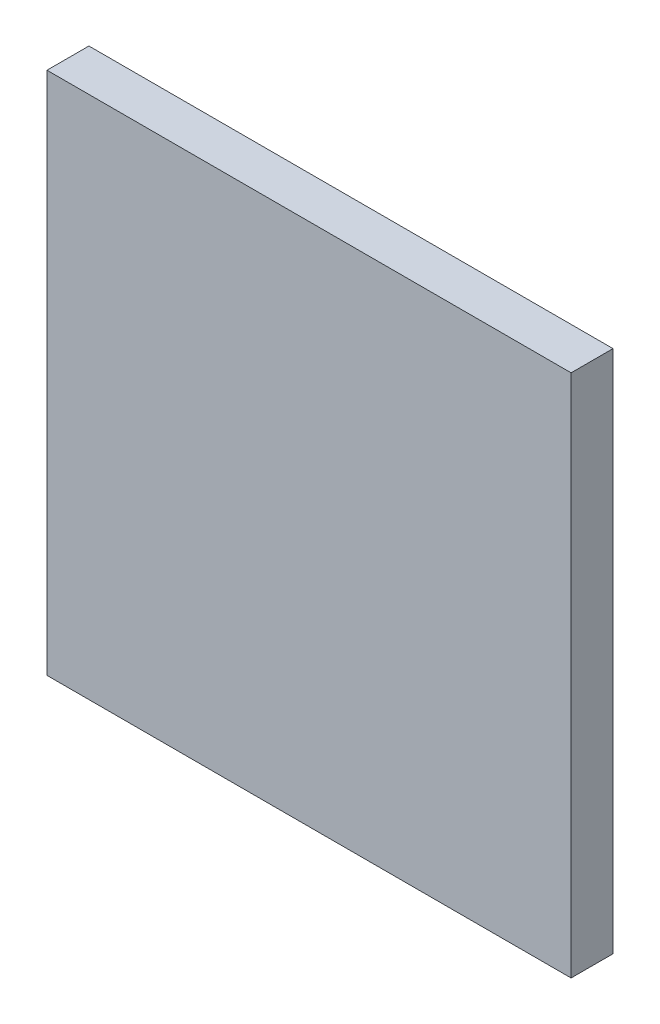
ISO-10303-21;
HEADER;
FILE_DESCRIPTION(('STEP AP214'),'2;1');
FILE_NAME('part.step','',(''),(''),'','','');
FILE_SCHEMA(('AUTOMOTIVE_DESIGN { 1 0 10303 214 1 1 1 1 }'));
ENDSEC;
DATA;
#1=APPLICATION_CONTEXT('core data for automotive mechanical design processes');
#2=APPLICATION_PROTOCOL_DEFINITION('international standard','automotive_design',2000,#1);
#3=PRODUCT_CONTEXT('',#1,'mechanical');
#4=PRODUCT('Part','Part','',(#3));
#5=PRODUCT_RELATED_PRODUCT_CATEGORY('part','',(#4));
#6=PRODUCT_DEFINITION_FORMATION('','',#4);
#7=PRODUCT_DEFINITION_CONTEXT('part definition',#1,'design');
#8=PRODUCT_DEFINITION('design','',#6,#7);
#9=PRODUCT_DEFINITION_SHAPE('','',#8);
#10=(LENGTH_UNIT() NAMED_UNIT(*) SI_UNIT(.MILLI.,.METRE.));
#11=(NAMED_UNIT(*) PLANE_ANGLE_UNIT() SI_UNIT($,.RADIAN.));
#12=(NAMED_UNIT(*) SI_UNIT($,.STERADIAN.) SOLID_ANGLE_UNIT());
#13=UNCERTAINTY_MEASURE_WITH_UNIT(LENGTH_MEASURE(1.E-05),#10,'distance_accuracy_value','');
#14=(GEOMETRIC_REPRESENTATION_CONTEXT(3) GLOBAL_UNCERTAINTY_ASSIGNED_CONTEXT((#13)) GLOBAL_UNIT_ASSIGNED_CONTEXT((#10,
#11,#12)) REPRESENTATION_CONTEXT('',''));
#15=CARTESIAN_POINT('',(0.,0.,0.));
#16=DIRECTION('',(0.,0.,1.));
#17=DIRECTION('',(1.,0.,0.));
#18=AXIS2_PLACEMENT_3D('',#15,#16,#17);
#19=CARTESIAN_POINT('',(233.308771728843,64.7931793490154,2.));
#20=DIRECTION('',(0.,1.,0.));
#21=DIRECTION('',(0.,0.,1.));
#22=AXIS2_PLACEMENT_3D('',#19,#20,#21);
#23=PLANE('',#22);
#24=DIRECTION('',(1.,0.,0.));
#25=VECTOR('',#24,1.);
#26=CARTESIAN_POINT('',(233.308771728843,64.7931793490154,0.));
#27=LINE('',#26,#25);
#28=CARTESIAN_POINT('',(208.308771728843,64.7931793490154,0.));
#29=VERTEX_POINT('',#28);
#30=CARTESIAN_POINT('',(233.308771728843,64.7931793490154,0.));
#31=VERTEX_POINT('',#30);
#32=EDGE_CURVE('E91',#29,#31,#27,.T.);
#33=ORIENTED_EDGE('',*,*,#32,.T.);
#34=DIRECTION('',(0.,0.,-1.));
#35=VECTOR('',#34,1.);
#36=CARTESIAN_POINT('',(233.308771728843,64.7931793490154,2.));
#37=LINE('',#36,#35);
#38=CARTESIAN_POINT('',(233.308771728843,64.7931793490154,2.));
#39=VERTEX_POINT('',#38);
#40=EDGE_CURVE('E45',#39,#31,#37,.T.);
#41=ORIENTED_EDGE('',*,*,#40,.F.);
#42=DIRECTION('',(1.,0.,0.));
#43=VECTOR('',#42,1.);
#44=CARTESIAN_POINT('',(233.308771728843,64.7931793490154,2.));
#45=LINE('',#44,#43);
#46=CARTESIAN_POINT('',(208.308771728843,64.7931793490154,2.));
#47=VERTEX_POINT('',#46);
#48=EDGE_CURVE('E84',#47,#39,#45,.T.);
#49=ORIENTED_EDGE('',*,*,#48,.F.);
#50=DIRECTION('',(0.,0.,-1.));
#51=VECTOR('',#50,1.);
#52=CARTESIAN_POINT('',(208.308771728843,64.7931793490154,2.));
#53=LINE('',#52,#51);
#54=EDGE_CURVE('E11',#47,#29,#53,.T.);
#55=ORIENTED_EDGE('',*,*,#54,.T.);
#56=EDGE_LOOP('',(#33,#41,#49,#55));
#57=FACE_BOUND('',#56,.T.);
#58=ADVANCED_FACE('F37',(#57),#23,.F.);
#59=CARTESIAN_POINT('',(233.308771728843,89.7931793490154,2.));
#60=DIRECTION('',(-1.,0.,0.));
#61=DIRECTION('',(0.,0.,1.));
#62=AXIS2_PLACEMENT_3D('',#59,#60,#61);
#63=PLANE('',#62);
#64=DIRECTION('',(0.,1.,0.));
#65=VECTOR('',#64,1.);
#66=CARTESIAN_POINT('',(233.308771728843,89.7931793490154,0.));
#67=LINE('',#66,#65);
#68=CARTESIAN_POINT('',(233.308771728843,89.7931793490154,0.));
#69=VERTEX_POINT('',#68);
#70=EDGE_CURVE('E71',#31,#69,#67,.T.);
#71=ORIENTED_EDGE('',*,*,#70,.T.);
#72=DIRECTION('',(0.,0.,-1.));
#73=VECTOR('',#72,1.);
#74=CARTESIAN_POINT('',(233.308771728843,89.7931793490154,2.));
#75=LINE('',#74,#73);
#76=CARTESIAN_POINT('',(233.308771728843,89.7931793490154,2.));
#77=VERTEX_POINT('',#76);
#78=EDGE_CURVE('E92',#77,#69,#75,.T.);
#79=ORIENTED_EDGE('',*,*,#78,.F.);
#80=DIRECTION('',(0.,1.,0.));
#81=VECTOR('',#80,1.);
#82=CARTESIAN_POINT('',(233.308771728843,89.7931793490154,2.));
#83=LINE('',#82,#81);
#84=EDGE_CURVE('E88',#39,#77,#83,.T.);
#85=ORIENTED_EDGE('',*,*,#84,.F.);
#86=ORIENTED_EDGE('',*,*,#40,.T.);
#87=EDGE_LOOP('',(#71,#79,#85,#86));
#88=FACE_BOUND('',#87,.T.);
#89=ADVANCED_FACE('F93',(#88),#63,.F.);
#90=CARTESIAN_POINT('',(208.308771728843,89.7931793490154,2.));
#91=DIRECTION('',(0.,-1.,0.));
#92=DIRECTION('',(0.,0.,-1.));
#93=AXIS2_PLACEMENT_3D('',#90,#91,#92);
#94=PLANE('',#93);
#95=DIRECTION('',(-1.,0.,0.));
#96=VECTOR('',#95,1.);
#97=CARTESIAN_POINT('',(208.308771728843,89.7931793490154,0.));
#98=LINE('',#97,#96);
#99=CARTESIAN_POINT('',(208.308771728843,89.7931793490154,0.));
#100=VERTEX_POINT('',#99);
#101=EDGE_CURVE('E78',#69,#100,#98,.T.);
#102=ORIENTED_EDGE('',*,*,#101,.T.);
#103=DIRECTION('',(0.,0.,-1.));
#104=VECTOR('',#103,1.);
#105=CARTESIAN_POINT('',(208.308771728843,89.7931793490154,2.));
#106=LINE('',#105,#104);
#107=CARTESIAN_POINT('',(208.308771728843,89.7931793490154,2.));
#108=VERTEX_POINT('',#107);
#109=EDGE_CURVE('E97',#108,#100,#106,.T.);
#110=ORIENTED_EDGE('',*,*,#109,.F.);
#111=DIRECTION('',(-1.,0.,0.));
#112=VECTOR('',#111,1.);
#113=CARTESIAN_POINT('',(208.308771728843,89.7931793490154,2.));
#114=LINE('',#113,#112);
#115=EDGE_CURVE('E95',#77,#108,#114,.T.);
#116=ORIENTED_EDGE('',*,*,#115,.F.);
#117=ORIENTED_EDGE('',*,*,#78,.T.);
#118=EDGE_LOOP('',(#102,#110,#116,#117));
#119=FACE_BOUND('',#118,.T.);
#120=ADVANCED_FACE('F107',(#119),#94,.F.);
#121=CARTESIAN_POINT('',(208.308771728843,77.2931793490154,2.));
#122=DIRECTION('',(1.,0.,0.));
#123=DIRECTION('',(0.,0.,-1.));
#124=AXIS2_PLACEMENT_3D('',#121,#122,#123);
#125=PLANE('',#124);
#126=DIRECTION('',(0.,-1.,0.));
#127=VECTOR('',#126,1.);
#128=CARTESIAN_POINT('',(208.308771728843,77.2931793490154,0.));
#129=LINE('',#128,#127);
#130=EDGE_CURVE('E104',#100,#29,#129,.T.);
#131=ORIENTED_EDGE('',*,*,#130,.T.);
#132=ORIENTED_EDGE('',*,*,#54,.F.);
#133=DIRECTION('',(0.,-1.,0.));
#134=VECTOR('',#133,1.);
#135=CARTESIAN_POINT('',(208.308771728843,64.7931793490154,2.));
#136=LINE('',#135,#134);
#137=EDGE_CURVE('E53',#108,#47,#136,.T.);
#138=ORIENTED_EDGE('',*,*,#137,.F.);
#139=ORIENTED_EDGE('',*,*,#109,.T.);
#140=EDGE_LOOP('',(#131,#132,#138,#139));
#141=FACE_BOUND('',#140,.T.);
#142=ADVANCED_FACE('F111',(#141),#125,.F.);
#143=CARTESIAN_POINT('',(0.,0.,2.));
#144=DIRECTION('',(0.,0.,-1.));
#145=DIRECTION('',(-1.,0.,0.));
#146=AXIS2_PLACEMENT_3D('',#143,#144,#145);
#147=PLANE('',#146);
#148=ORIENTED_EDGE('',*,*,#137,.T.);
#149=ORIENTED_EDGE('',*,*,#48,.T.);
#150=ORIENTED_EDGE('',*,*,#84,.T.);
#151=ORIENTED_EDGE('',*,*,#115,.T.);
#152=EDGE_LOOP('',(#148,#149,#150,#151));
#153=FACE_BOUND('',#152,.T.);
#154=ADVANCED_FACE('F86',(#153),#147,.F.);
#155=CARTESIAN_POINT('',(0.,0.,0.));
#156=DIRECTION('',(0.,0.,-1.));
#157=DIRECTION('',(-1.,0.,0.));
#158=AXIS2_PLACEMENT_3D('',#155,#156,#157);
#159=PLANE('',#158);
#160=ORIENTED_EDGE('',*,*,#32,.F.);
#161=ORIENTED_EDGE('',*,*,#130,.F.);
#162=ORIENTED_EDGE('',*,*,#101,.F.);
#163=ORIENTED_EDGE('',*,*,#70,.F.);
#164=EDGE_LOOP('',(#160,#161,#162,#163));
#165=FACE_BOUND('',#164,.T.);
#166=ADVANCED_FACE('F110',(#165),#159,.T.);
#167=CLOSED_SHELL('',(#58,#89,#120,#142,#154,#166));
#168=MANIFOLD_SOLID_BREP('B2',#167);
#169=ADVANCED_BREP_SHAPE_REPRESENTATION('',(#18,#168),#14);
#170=SHAPE_DEFINITION_REPRESENTATION(#9,#169);
ENDSEC;
END-ISO-10303-21;
